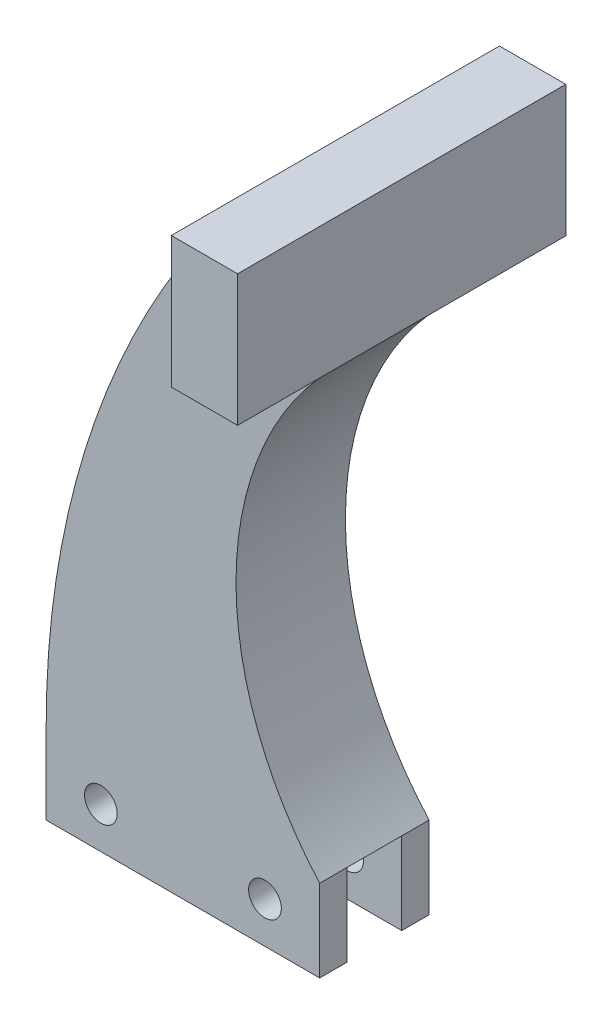
ISO-10303-21;
HEADER;
FILE_DESCRIPTION(('STEP AP214'),'2;1');
FILE_NAME('part.step','',(''),(''),'','','');
FILE_SCHEMA(('AUTOMOTIVE_DESIGN { 1 0 10303 214 1 1 1 1 }'));
ENDSEC;
DATA;
#1=APPLICATION_CONTEXT('core data for automotive mechanical design processes');
#2=APPLICATION_PROTOCOL_DEFINITION('international standard','automotive_design',2000,#1);
#3=PRODUCT_CONTEXT('',#1,'mechanical');
#4=PRODUCT('Part','Part','',(#3));
#5=PRODUCT_RELATED_PRODUCT_CATEGORY('part','',(#4));
#6=PRODUCT_DEFINITION_FORMATION('','',#4);
#7=PRODUCT_DEFINITION_CONTEXT('part definition',#1,'design');
#8=PRODUCT_DEFINITION('design','',#6,#7);
#9=PRODUCT_DEFINITION_SHAPE('','',#8);
#10=(LENGTH_UNIT() NAMED_UNIT(*) SI_UNIT(.MILLI.,.METRE.));
#11=(NAMED_UNIT(*) PLANE_ANGLE_UNIT() SI_UNIT($,.RADIAN.));
#12=(NAMED_UNIT(*) SI_UNIT($,.STERADIAN.) SOLID_ANGLE_UNIT());
#13=UNCERTAINTY_MEASURE_WITH_UNIT(LENGTH_MEASURE(1.E-05),#10,'distance_accuracy_value','');
#14=(GEOMETRIC_REPRESENTATION_CONTEXT(3) GLOBAL_UNCERTAINTY_ASSIGNED_CONTEXT((#13)) GLOBAL_UNIT_ASSIGNED_CONTEXT((#10,
#11,#12)) REPRESENTATION_CONTEXT('',''));
#15=CARTESIAN_POINT('',(0.,0.,0.));
#16=DIRECTION('',(0.,0.,1.));
#17=DIRECTION('',(1.,0.,0.));
#18=AXIS2_PLACEMENT_3D('',#15,#16,#17);
#19=CARTESIAN_POINT('',(85.725,9.525,-12.7));
#20=DIRECTION('',(0.,0.,1.));
#21=DIRECTION('',(1.,0.,0.));
#22=AXIS2_PLACEMENT_3D('',#19,#20,#21);
#23=PLANE('',#22);
#24=CARTESIAN_POINT('',(-9.525,4.7625,-12.7));
#25=DIRECTION('',(0.,0.,1.));
#26=DIRECTION('',(1.,0.,0.));
#27=AXIS2_PLACEMENT_3D('',#24,#25,#26);
#28=CIRCLE('',#27,1.89865);
#29=CARTESIAN_POINT('',(-7.62635,4.7625,-12.7));
#30=VERTEX_POINT('',#29);
#31=EDGE_CURVE('E211',#30,#30,#28,.T.);
#32=ORIENTED_EDGE('',*,*,#31,.T.);
#33=EDGE_LOOP('',(#32));
#34=FACE_BOUND('',#33,.T.);
#35=CARTESIAN_POINT('',(9.525,4.7625,-12.7));
#36=DIRECTION('',(0.,0.,1.));
#37=DIRECTION('',(1.,0.,0.));
#38=AXIS2_PLACEMENT_3D('',#35,#36,#37);
#39=CIRCLE('',#38,1.89865);
#40=CARTESIAN_POINT('',(11.42365,4.7625,-12.7));
#41=VERTEX_POINT('',#40);
#42=EDGE_CURVE('E199',#41,#41,#39,.T.);
#43=ORIENTED_EDGE('',*,*,#42,.T.);
#44=EDGE_LOOP('',(#43));
#45=FACE_BOUND('',#44,.T.);
#46=DIRECTION('',(0.,1.,0.));
#47=VECTOR('',#46,1.);
#48=CARTESIAN_POINT('',(11.3486342982531,9.52499999999999,-12.7));
#49=LINE('',#48,#47);
#50=CARTESIAN_POINT('',(11.3486342982531,63.5,-12.7));
#51=VERTEX_POINT('',#50);
#52=CARTESIAN_POINT('',(11.3486342982531,78.74,-12.7));
#53=VERTEX_POINT('',#52);
#54=EDGE_CURVE('E193',#51,#53,#49,.T.);
#55=ORIENTED_EDGE('',*,*,#54,.F.);
#56=DIRECTION('',(-1.,0.,0.));
#57=VECTOR('',#56,1.);
#58=CARTESIAN_POINT('',(85.725,63.5,-12.7));
#59=LINE('',#58,#57);
#60=CARTESIAN_POINT('',(19.05,63.5,-12.7));
#61=VERTEX_POINT('',#60);
#62=EDGE_CURVE('E190',#61,#51,#59,.T.);
#63=ORIENTED_EDGE('',*,*,#62,.F.);
#64=CARTESIAN_POINT('',(44.2632330501586,34.9359862911671,-12.7));
#65=DIRECTION('',(0.,0.,-1.));
#66=DIRECTION('',(1.,0.,0.));
#67=AXIS2_PLACEMENT_3D('',#64,#65,#66);
#68=CIRCLE('',#67,38.1);
#69=CARTESIAN_POINT('',(15.875,9.525,-12.7));
#70=VERTEX_POINT('',#69);
#71=EDGE_CURVE('E244',#70,#61,#68,.T.);
#72=ORIENTED_EDGE('',*,*,#71,.F.);
#73=DIRECTION('',(0.,1.,0.));
#74=VECTOR('',#73,1.);
#75=CARTESIAN_POINT('',(15.875,0.,-12.7));
#76=LINE('',#75,#74);
#77=CARTESIAN_POINT('',(15.875,0.,-12.7));
#78=VERTEX_POINT('',#77);
#79=EDGE_CURVE('E241',#78,#70,#76,.T.);
#80=ORIENTED_EDGE('',*,*,#79,.F.);
#81=DIRECTION('',(1.,0.,0.));
#82=VECTOR('',#81,1.);
#83=CARTESIAN_POINT('',(-15.875,0.,-12.7));
#84=LINE('',#83,#82);
#85=CARTESIAN_POINT('',(-15.875,0.,-12.7));
#86=VERTEX_POINT('',#85);
#87=EDGE_CURVE('E237',#86,#78,#84,.T.);
#88=ORIENTED_EDGE('',*,*,#87,.F.);
#89=DIRECTION('',(0.,-1.,0.));
#90=VECTOR('',#89,1.);
#91=CARTESIAN_POINT('',(-15.875,0.,-12.7));
#92=LINE('',#91,#90);
#93=CARTESIAN_POINT('',(-15.875,9.52500000000001,-12.7));
#94=VERTEX_POINT('',#93);
#95=EDGE_CURVE('E234',#94,#86,#92,.T.);
#96=ORIENTED_EDGE('',*,*,#95,.F.);
#97=CARTESIAN_POINT('',(85.725,9.525,-12.7));
#98=DIRECTION('',(0.,0.,1.));
#99=DIRECTION('',(1.,0.,0.));
#100=AXIS2_PLACEMENT_3D('',#97,#98,#99);
#101=CIRCLE('',#100,101.6);
#102=EDGE_CURVE('E247',#53,#94,#101,.T.);
#103=ORIENTED_EDGE('',*,*,#102,.F.);
#104=EDGE_LOOP('',(#55,#63,#72,#80,#88,#96,#103));
#105=FACE_BOUND('',#104,.T.);
#106=ADVANCED_FACE('F35',(#34,#45,#105),#23,.F.);
#107=CARTESIAN_POINT('',(85.725,9.525,0.));
#108=DIRECTION('',(0.,0.,1.));
#109=DIRECTION('',(1.,0.,0.));
#110=AXIS2_PLACEMENT_3D('',#107,#108,#109);
#111=PLANE('',#110);
#112=CARTESIAN_POINT('',(9.525,4.7625,0.));
#113=DIRECTION('',(0.,0.,1.));
#114=DIRECTION('',(1.,0.,0.));
#115=AXIS2_PLACEMENT_3D('',#112,#113,#114);
#116=CIRCLE('',#115,1.89865);
#117=CARTESIAN_POINT('',(11.42365,4.7625,0.));
#118=VERTEX_POINT('',#117);
#119=EDGE_CURVE('E196',#118,#118,#116,.T.);
#120=ORIENTED_EDGE('',*,*,#119,.F.);
#121=EDGE_LOOP('',(#120));
#122=FACE_BOUND('',#121,.T.);
#123=CARTESIAN_POINT('',(-9.525,4.7625,0.));
#124=DIRECTION('',(0.,0.,1.));
#125=DIRECTION('',(1.,0.,0.));
#126=AXIS2_PLACEMENT_3D('',#123,#124,#125);
#127=CIRCLE('',#126,1.89865);
#128=CARTESIAN_POINT('',(-7.62635,4.7625,0.));
#129=VERTEX_POINT('',#128);
#130=EDGE_CURVE('E208',#129,#129,#127,.T.);
#131=ORIENTED_EDGE('',*,*,#130,.F.);
#132=EDGE_LOOP('',(#131));
#133=FACE_BOUND('',#132,.T.);
#134=DIRECTION('',(-1.,0.,0.));
#135=VECTOR('',#134,1.);
#136=CARTESIAN_POINT('',(85.725,63.5,0.));
#137=LINE('',#136,#135);
#138=CARTESIAN_POINT('',(19.05,63.5,0.));
#139=VERTEX_POINT('',#138);
#140=CARTESIAN_POINT('',(11.3486342982531,63.5,0.));
#141=VERTEX_POINT('',#140);
#142=EDGE_CURVE('E43',#139,#141,#137,.T.);
#143=ORIENTED_EDGE('',*,*,#142,.T.);
#144=DIRECTION('',(0.,1.,0.));
#145=VECTOR('',#144,1.);
#146=CARTESIAN_POINT('',(11.3486342982531,9.52499999999999,0.));
#147=LINE('',#146,#145);
#148=CARTESIAN_POINT('',(11.3486342982531,78.74,0.));
#149=VERTEX_POINT('',#148);
#150=EDGE_CURVE('E11',#141,#149,#147,.T.);
#151=ORIENTED_EDGE('',*,*,#150,.T.);
#152=CARTESIAN_POINT('',(85.725,9.525,0.));
#153=DIRECTION('',(0.,0.,1.));
#154=DIRECTION('',(1.,0.,0.));
#155=AXIS2_PLACEMENT_3D('',#152,#153,#154);
#156=CIRCLE('',#155,101.6);
#157=CARTESIAN_POINT('',(-15.875,9.52500000000001,0.));
#158=VERTEX_POINT('',#157);
#159=EDGE_CURVE('E238',#149,#158,#156,.T.);
#160=ORIENTED_EDGE('',*,*,#159,.T.);
#161=DIRECTION('',(0.,-1.,0.));
#162=VECTOR('',#161,1.);
#163=CARTESIAN_POINT('',(-15.875,0.,0.));
#164=LINE('',#163,#162);
#165=CARTESIAN_POINT('',(-15.875,0.,0.));
#166=VERTEX_POINT('',#165);
#167=EDGE_CURVE('E233',#158,#166,#164,.T.);
#168=ORIENTED_EDGE('',*,*,#167,.T.);
#169=DIRECTION('',(1.,0.,0.));
#170=VECTOR('',#169,1.);
#171=CARTESIAN_POINT('',(-15.875,0.,0.));
#172=LINE('',#171,#170);
#173=CARTESIAN_POINT('',(15.875,0.,0.));
#174=VERTEX_POINT('',#173);
#175=EDGE_CURVE('E253',#166,#174,#172,.T.);
#176=ORIENTED_EDGE('',*,*,#175,.T.);
#177=DIRECTION('',(0.,1.,0.));
#178=VECTOR('',#177,1.);
#179=CARTESIAN_POINT('',(15.875,0.,0.));
#180=LINE('',#179,#178);
#181=CARTESIAN_POINT('',(15.875,9.525,0.));
#182=VERTEX_POINT('',#181);
#183=EDGE_CURVE('E256',#174,#182,#180,.T.);
#184=ORIENTED_EDGE('',*,*,#183,.T.);
#185=CARTESIAN_POINT('',(44.2632330501586,34.9359862911671,0.));
#186=DIRECTION('',(0.,0.,-1.));
#187=DIRECTION('',(1.,0.,0.));
#188=AXIS2_PLACEMENT_3D('',#185,#186,#187);
#189=CIRCLE('',#188,38.1);
#190=EDGE_CURVE('E259',#182,#139,#189,.T.);
#191=ORIENTED_EDGE('',*,*,#190,.T.);
#192=EDGE_LOOP('',(#143,#151,#160,#168,#176,#184,#191));
#193=FACE_BOUND('',#192,.T.);
#194=ADVANCED_FACE('F290',(#122,#133,#193),#111,.T.);
#195=CARTESIAN_POINT('',(-15.875,0.,-12.7));
#196=DIRECTION('',(-1.,0.,0.));
#197=DIRECTION('',(0.,0.,1.));
#198=AXIS2_PLACEMENT_3D('',#195,#196,#197);
#199=PLANE('',#198);
#200=DIRECTION('',(0.,-1.,0.));
#201=VECTOR('',#200,1.);
#202=CARTESIAN_POINT('',(-15.875,0.,-9.525));
#203=LINE('',#202,#201);
#204=CARTESIAN_POINT('',(-15.875,9.52499999999999,-9.525));
#205=VERTEX_POINT('',#204);
#206=CARTESIAN_POINT('',(-15.875,0.,-9.525));
#207=VERTEX_POINT('',#206);
#208=EDGE_CURVE('E224',#205,#207,#203,.T.);
#209=ORIENTED_EDGE('',*,*,#208,.F.);
#210=DIRECTION('',(0.,0.,1.));
#211=VECTOR('',#210,1.);
#212=CARTESIAN_POINT('',(-15.875,9.52500000000001,-12.7));
#213=LINE('',#212,#211);
#214=EDGE_CURVE('E264',#94,#205,#213,.T.);
#215=ORIENTED_EDGE('',*,*,#214,.F.);
#216=ORIENTED_EDGE('',*,*,#95,.T.);
#217=DIRECTION('',(0.,0.,1.));
#218=VECTOR('',#217,1.);
#219=CARTESIAN_POINT('',(-15.875,0.,-12.7));
#220=LINE('',#219,#218);
#221=EDGE_CURVE('E281',#86,#207,#220,.T.);
#222=ORIENTED_EDGE('',*,*,#221,.T.);
#223=EDGE_LOOP('',(#209,#215,#216,#222));
#224=FACE_BOUND('',#223,.T.);
#225=ADVANCED_FACE('F356',(#224),#199,.T.);
#226=CARTESIAN_POINT('',(15.875,0.,-12.7));
#227=DIRECTION('',(1.,0.,0.));
#228=DIRECTION('',(0.,0.,-1.));
#229=AXIS2_PLACEMENT_3D('',#226,#227,#228);
#230=PLANE('',#229);
#231=DIRECTION('',(0.,1.,0.));
#232=VECTOR('',#231,1.);
#233=CARTESIAN_POINT('',(15.875,0.,-9.525));
#234=LINE('',#233,#232);
#235=CARTESIAN_POINT('',(15.875,0.,-9.525));
#236=VERTEX_POINT('',#235);
#237=CARTESIAN_POINT('',(15.875,9.52499999999999,-9.525));
#238=VERTEX_POINT('',#237);
#239=EDGE_CURVE('E231',#236,#238,#234,.T.);
#240=ORIENTED_EDGE('',*,*,#239,.F.);
#241=DIRECTION('',(0.,0.,1.));
#242=VECTOR('',#241,1.);
#243=CARTESIAN_POINT('',(15.875,0.,-12.7));
#244=LINE('',#243,#242);
#245=EDGE_CURVE('E277',#78,#236,#244,.T.);
#246=ORIENTED_EDGE('',*,*,#245,.F.);
#247=ORIENTED_EDGE('',*,*,#79,.T.);
#248=DIRECTION('',(0.,0.,1.));
#249=VECTOR('',#248,1.);
#250=CARTESIAN_POINT('',(15.875,9.525,-12.7));
#251=LINE('',#250,#249);
#252=EDGE_CURVE('E272',#70,#238,#251,.T.);
#253=ORIENTED_EDGE('',*,*,#252,.T.);
#254=EDGE_LOOP('',(#240,#246,#247,#253));
#255=FACE_BOUND('',#254,.T.);
#256=ADVANCED_FACE('F370',(#255),#230,.T.);
#257=CARTESIAN_POINT('',(-15.875,0.,-12.7));
#258=DIRECTION('',(0.,-1.,0.));
#259=DIRECTION('',(1.,0.,0.));
#260=AXIS2_PLACEMENT_3D('',#257,#258,#259);
#261=PLANE('',#260);
#262=DIRECTION('',(1.,0.,0.));
#263=VECTOR('',#262,1.);
#264=CARTESIAN_POINT('',(-15.875,0.,-9.525));
#265=LINE('',#264,#263);
#266=EDGE_CURVE('E285',#207,#236,#265,.T.);
#267=ORIENTED_EDGE('',*,*,#266,.F.);
#268=ORIENTED_EDGE('',*,*,#221,.F.);
#269=ORIENTED_EDGE('',*,*,#87,.T.);
#270=ORIENTED_EDGE('',*,*,#245,.T.);
#271=EDGE_LOOP('',(#267,#268,#269,#270));
#272=FACE_BOUND('',#271,.T.);
#273=ADVANCED_FACE('F372',(#272),#261,.T.);
#274=DIRECTION('',(0.,1.,0.));
#275=VECTOR('',#274,1.);
#276=CARTESIAN_POINT('',(-15.875,9.52499999999999,-3.175));
#277=LINE('',#276,#275);
#278=CARTESIAN_POINT('',(-15.875,0.,-3.175));
#279=VERTEX_POINT('',#278);
#280=CARTESIAN_POINT('',(-15.875,9.52499999999999,-3.175));
#281=VERTEX_POINT('',#280);
#282=EDGE_CURVE('E218',#279,#281,#277,.T.);
#283=ORIENTED_EDGE('',*,*,#282,.F.);
#284=EDGE_CURVE('E250',#279,#166,#220,.T.);
#285=ORIENTED_EDGE('',*,*,#284,.T.);
#286=ORIENTED_EDGE('',*,*,#167,.F.);
#287=EDGE_CURVE('E268',#281,#158,#213,.T.);
#288=ORIENTED_EDGE('',*,*,#287,.F.);
#289=EDGE_LOOP('',(#283,#285,#286,#288));
#290=FACE_BOUND('',#289,.T.);
#291=ADVANCED_FACE('F37',(#290),#199,.T.);
#292=CARTESIAN_POINT('',(85.725,9.525,-12.7));
#293=DIRECTION('',(0.,0.,1.));
#294=DIRECTION('',(1.,0.,0.));
#295=AXIS2_PLACEMENT_3D('',#292,#293,#294);
#296=CYLINDRICAL_SURFACE('',#295,101.6);
#297=ORIENTED_EDGE('',*,*,#159,.F.);
#298=DIRECTION('',(0.,0.,1.));
#299=VECTOR('',#298,1.);
#300=CARTESIAN_POINT('',(11.3486342982531,78.74,-12.7));
#301=LINE('',#300,#299);
#302=EDGE_CURVE('E155',#53,#149,#301,.T.);
#303=ORIENTED_EDGE('',*,*,#302,.F.);
#304=ORIENTED_EDGE('',*,*,#102,.T.);
#305=ORIENTED_EDGE('',*,*,#214,.T.);
#306=DIRECTION('',(0.,0.,-1.));
#307=VECTOR('',#306,1.);
#308=CARTESIAN_POINT('',(-15.875,9.52499999999999,-9.525));
#309=LINE('',#308,#307);
#310=EDGE_CURVE('E221',#281,#205,#309,.T.);
#311=ORIENTED_EDGE('',*,*,#310,.F.);
#312=ORIENTED_EDGE('',*,*,#287,.T.);
#313=EDGE_LOOP('',(#297,#303,#304,#305,#311,#312));
#314=FACE_BOUND('',#313,.T.);
#315=ADVANCED_FACE('F317',(#314),#296,.T.);
#316=CARTESIAN_POINT('',(19.05,78.74,-12.7));
#317=DIRECTION('',(0.,1.,0.));
#318=DIRECTION('',(-1.,0.,0.));
#319=AXIS2_PLACEMENT_3D('',#316,#317,#318);
#320=PLANE('',#319);
#321=ORIENTED_EDGE('',*,*,#302,.T.);
#322=DIRECTION('',(0.,0.,-1.));
#323=VECTOR('',#322,1.);
#324=CARTESIAN_POINT('',(11.3486342982531,78.74,12.7));
#325=LINE('',#324,#323);
#326=CARTESIAN_POINT('',(11.3486342982531,78.74,12.7));
#327=VERTEX_POINT('',#326);
#328=EDGE_CURVE('E162',#327,#149,#325,.T.);
#329=ORIENTED_EDGE('',*,*,#328,.F.);
#330=DIRECTION('',(-1.,0.,0.));
#331=VECTOR('',#330,1.);
#332=CARTESIAN_POINT('',(19.05,78.74,12.7));
#333=LINE('',#332,#331);
#334=CARTESIAN_POINT('',(19.05,78.74,12.7));
#335=VERTEX_POINT('',#334);
#336=EDGE_CURVE('E159',#335,#327,#333,.T.);
#337=ORIENTED_EDGE('',*,*,#336,.F.);
#338=DIRECTION('',(0.,0.,1.));
#339=VECTOR('',#338,1.);
#340=CARTESIAN_POINT('',(19.05,78.74,-12.7));
#341=LINE('',#340,#339);
#342=CARTESIAN_POINT('',(19.05,78.74,-25.4));
#343=VERTEX_POINT('',#342);
#344=EDGE_CURVE('E144',#343,#335,#341,.T.);
#345=ORIENTED_EDGE('',*,*,#344,.F.);
#346=DIRECTION('',(-1.,0.,0.));
#347=VECTOR('',#346,1.);
#348=CARTESIAN_POINT('',(19.05,78.74,-25.4));
#349=LINE('',#348,#347);
#350=CARTESIAN_POINT('',(11.3486342982531,78.74,-25.4));
#351=VERTEX_POINT('',#350);
#352=EDGE_CURVE('E180',#343,#351,#349,.T.);
#353=ORIENTED_EDGE('',*,*,#352,.T.);
#354=EDGE_CURVE('E188',#53,#351,#325,.T.);
#355=ORIENTED_EDGE('',*,*,#354,.F.);
#356=EDGE_LOOP('',(#321,#329,#337,#345,#353,#355));
#357=FACE_BOUND('',#356,.T.);
#358=ADVANCED_FACE('F161',(#357),#320,.T.);
#359=CARTESIAN_POINT('',(19.05,63.5,-12.7));
#360=DIRECTION('',(1.,0.,0.));
#361=DIRECTION('',(0.,0.,-1.));
#362=AXIS2_PLACEMENT_3D('',#359,#360,#361);
#363=PLANE('',#362);
#364=ORIENTED_EDGE('',*,*,#344,.T.);
#365=DIRECTION('',(0.,1.,0.));
#366=VECTOR('',#365,1.);
#367=CARTESIAN_POINT('',(19.05,63.5,12.7));
#368=LINE('',#367,#366);
#369=CARTESIAN_POINT('',(19.05,63.5,12.7));
#370=VERTEX_POINT('',#369);
#371=EDGE_CURVE('E149',#370,#335,#368,.T.);
#372=ORIENTED_EDGE('',*,*,#371,.F.);
#373=DIRECTION('',(0.,0.,-1.));
#374=VECTOR('',#373,1.);
#375=CARTESIAN_POINT('',(19.05,63.5,12.7));
#376=LINE('',#375,#374);
#377=EDGE_CURVE('E184',#370,#139,#376,.T.);
#378=ORIENTED_EDGE('',*,*,#377,.T.);
#379=DIRECTION('',(0.,0.,1.));
#380=VECTOR('',#379,1.);
#381=CARTESIAN_POINT('',(19.05,63.5,-12.7));
#382=LINE('',#381,#380);
#383=EDGE_CURVE('E156',#61,#139,#382,.T.);
#384=ORIENTED_EDGE('',*,*,#383,.F.);
#385=CARTESIAN_POINT('',(19.05,63.5,-25.4));
#386=VERTEX_POINT('',#385);
#387=EDGE_CURVE('E178',#61,#386,#376,.T.);
#388=ORIENTED_EDGE('',*,*,#387,.T.);
#389=DIRECTION('',(0.,1.,0.));
#390=VECTOR('',#389,1.);
#391=CARTESIAN_POINT('',(19.05,63.5,-25.4));
#392=LINE('',#391,#390);
#393=EDGE_CURVE('E151',#386,#343,#392,.T.);
#394=ORIENTED_EDGE('',*,*,#393,.T.);
#395=EDGE_LOOP('',(#364,#372,#378,#384,#388,#394));
#396=FACE_BOUND('',#395,.T.);
#397=ADVANCED_FACE('F146',(#396),#363,.T.);
#398=CARTESIAN_POINT('',(44.2632330501586,34.9359862911671,-12.7));
#399=DIRECTION('',(0.,0.,1.));
#400=DIRECTION('',(1.,0.,0.));
#401=AXIS2_PLACEMENT_3D('',#398,#399,#400);
#402=CYLINDRICAL_SURFACE('',#401,38.1);
#403=ORIENTED_EDGE('',*,*,#190,.F.);
#404=CARTESIAN_POINT('',(15.875,9.52499999999999,-3.175));
#405=VERTEX_POINT('',#404);
#406=EDGE_CURVE('E276',#405,#182,#251,.T.);
#407=ORIENTED_EDGE('',*,*,#406,.F.);
#408=EDGE_CURVE('E275',#238,#405,#251,.T.);
#409=ORIENTED_EDGE('',*,*,#408,.F.);
#410=ORIENTED_EDGE('',*,*,#252,.F.);
#411=ORIENTED_EDGE('',*,*,#71,.T.);
#412=ORIENTED_EDGE('',*,*,#383,.T.);
#413=EDGE_LOOP('',(#403,#407,#409,#410,#411,#412));
#414=FACE_BOUND('',#413,.T.);
#415=ADVANCED_FACE('F295',(#414),#402,.F.);
#416=DIRECTION('',(0.,-1.,0.));
#417=VECTOR('',#416,1.);
#418=CARTESIAN_POINT('',(15.875,0.,-3.175));
#419=LINE('',#418,#417);
#420=CARTESIAN_POINT('',(15.875,0.,-3.175));
#421=VERTEX_POINT('',#420);
#422=EDGE_CURVE('E58',#405,#421,#419,.T.);
#423=ORIENTED_EDGE('',*,*,#422,.F.);
#424=ORIENTED_EDGE('',*,*,#406,.T.);
#425=ORIENTED_EDGE('',*,*,#183,.F.);
#426=EDGE_CURVE('E280',#421,#174,#244,.T.);
#427=ORIENTED_EDGE('',*,*,#426,.F.);
#428=EDGE_LOOP('',(#423,#424,#425,#427));
#429=FACE_BOUND('',#428,.T.);
#430=ADVANCED_FACE('F330',(#429),#230,.T.);
#431=DIRECTION('',(-1.,0.,0.));
#432=VECTOR('',#431,1.);
#433=CARTESIAN_POINT('',(-15.875,0.,-3.175));
#434=LINE('',#433,#432);
#435=EDGE_CURVE('E267',#421,#279,#434,.T.);
#436=ORIENTED_EDGE('',*,*,#435,.F.);
#437=ORIENTED_EDGE('',*,*,#426,.T.);
#438=ORIENTED_EDGE('',*,*,#175,.F.);
#439=ORIENTED_EDGE('',*,*,#284,.F.);
#440=EDGE_LOOP('',(#436,#437,#438,#439));
#441=FACE_BOUND('',#440,.T.);
#442=ADVANCED_FACE('F326',(#441),#261,.T.);
#443=CARTESIAN_POINT('',(19.05,0.,-9.525));
#444=DIRECTION('',(0.,0.,-1.));
#445=DIRECTION('',(0.,1.,0.));
#446=AXIS2_PLACEMENT_3D('',#443,#444,#445);
#447=PLANE('',#446);
#448=CARTESIAN_POINT('',(9.525,4.7625,-9.525));
#449=DIRECTION('',(0.,0.,-1.));
#450=DIRECTION('',(0.,1.,0.));
#451=AXIS2_PLACEMENT_3D('',#448,#449,#450);
#452=CIRCLE('',#451,1.89865);
#453=CARTESIAN_POINT('',(9.525,6.66115,-9.525));
#454=VERTEX_POINT('',#453);
#455=EDGE_CURVE('E202',#454,#454,#452,.T.);
#456=ORIENTED_EDGE('',*,*,#455,.T.);
#457=EDGE_LOOP('',(#456));
#458=FACE_BOUND('',#457,.T.);
#459=CARTESIAN_POINT('',(-9.525,4.7625,-9.525));
#460=DIRECTION('',(0.,0.,-1.));
#461=DIRECTION('',(0.,1.,0.));
#462=AXIS2_PLACEMENT_3D('',#459,#460,#461);
#463=CIRCLE('',#462,1.89865);
#464=CARTESIAN_POINT('',(-9.525,6.66115,-9.525));
#465=VERTEX_POINT('',#464);
#466=EDGE_CURVE('E215',#465,#465,#463,.T.);
#467=ORIENTED_EDGE('',*,*,#466,.T.);
#468=EDGE_LOOP('',(#467));
#469=FACE_BOUND('',#468,.T.);
#470=ORIENTED_EDGE('',*,*,#239,.T.);
#471=DIRECTION('',(-1.,0.,0.));
#472=VECTOR('',#471,1.);
#473=CARTESIAN_POINT('',(19.05,9.52499999999999,-9.525));
#474=LINE('',#473,#472);
#475=EDGE_CURVE('E227',#238,#205,#474,.T.);
#476=ORIENTED_EDGE('',*,*,#475,.T.);
#477=ORIENTED_EDGE('',*,*,#208,.T.);
#478=ORIENTED_EDGE('',*,*,#266,.T.);
#479=EDGE_LOOP('',(#470,#476,#477,#478));
#480=FACE_BOUND('',#479,.T.);
#481=ADVANCED_FACE('F346',(#458,#469,#480),#447,.F.);
#482=CARTESIAN_POINT('',(19.05,9.52499999999999,-9.525));
#483=DIRECTION('',(0.,1.,0.));
#484=DIRECTION('',(0.,0.,1.));
#485=AXIS2_PLACEMENT_3D('',#482,#483,#484);
#486=PLANE('',#485);
#487=ORIENTED_EDGE('',*,*,#408,.T.);
#488=DIRECTION('',(-1.,0.,0.));
#489=VECTOR('',#488,1.);
#490=CARTESIAN_POINT('',(19.05,9.52499999999999,-3.175));
#491=LINE('',#490,#489);
#492=EDGE_CURVE('E226',#405,#281,#491,.T.);
#493=ORIENTED_EDGE('',*,*,#492,.T.);
#494=ORIENTED_EDGE('',*,*,#310,.T.);
#495=ORIENTED_EDGE('',*,*,#475,.F.);
#496=EDGE_LOOP('',(#487,#493,#494,#495));
#497=FACE_BOUND('',#496,.T.);
#498=ADVANCED_FACE('F333',(#497),#486,.F.);
#499=CARTESIAN_POINT('',(19.05,9.52499999999999,-3.175));
#500=DIRECTION('',(0.,0.,1.));
#501=DIRECTION('',(0.,-1.,0.));
#502=AXIS2_PLACEMENT_3D('',#499,#500,#501);
#503=PLANE('',#502);
#504=CARTESIAN_POINT('',(9.525,4.7625,-3.175));
#505=DIRECTION('',(0.,0.,1.));
#506=DIRECTION('',(0.,-1.,0.));
#507=AXIS2_PLACEMENT_3D('',#504,#505,#506);
#508=CIRCLE('',#507,1.89865);
#509=CARTESIAN_POINT('',(9.525,2.86385,-3.175));
#510=VERTEX_POINT('',#509);
#511=EDGE_CURVE('E205',#510,#510,#508,.T.);
#512=ORIENTED_EDGE('',*,*,#511,.T.);
#513=EDGE_LOOP('',(#512));
#514=FACE_BOUND('',#513,.T.);
#515=CARTESIAN_POINT('',(-9.525,4.7625,-3.175));
#516=DIRECTION('',(0.,0.,1.));
#517=DIRECTION('',(0.,-1.,0.));
#518=AXIS2_PLACEMENT_3D('',#515,#516,#517);
#519=CIRCLE('',#518,1.89865);
#520=CARTESIAN_POINT('',(-9.525,2.86385,-3.175));
#521=VERTEX_POINT('',#520);
#522=EDGE_CURVE('E214',#521,#521,#519,.T.);
#523=ORIENTED_EDGE('',*,*,#522,.T.);
#524=EDGE_LOOP('',(#523));
#525=FACE_BOUND('',#524,.T.);
#526=ORIENTED_EDGE('',*,*,#422,.T.);
#527=ORIENTED_EDGE('',*,*,#435,.T.);
#528=ORIENTED_EDGE('',*,*,#282,.T.);
#529=ORIENTED_EDGE('',*,*,#492,.F.);
#530=EDGE_LOOP('',(#526,#527,#528,#529));
#531=FACE_BOUND('',#530,.T.);
#532=ADVANCED_FACE('F334',(#514,#525,#531),#503,.F.);
#533=CARTESIAN_POINT('',(-9.525,4.7625,0.));
#534=DIRECTION('',(0.,0.,1.));
#535=DIRECTION('',(1.,0.,0.));
#536=AXIS2_PLACEMENT_3D('',#533,#534,#535);
#537=CYLINDRICAL_SURFACE('',#536,1.89865);
#538=ORIENTED_EDGE('',*,*,#130,.T.);
#539=EDGE_LOOP('',(#538));
#540=FACE_BOUND('',#539,.T.);
#541=ORIENTED_EDGE('',*,*,#522,.F.);
#542=EDGE_LOOP('',(#541));
#543=FACE_BOUND('',#542,.T.);
#544=ADVANCED_FACE('F336',(#540,#543),#537,.F.);
#545=ORIENTED_EDGE('',*,*,#31,.F.);
#546=EDGE_LOOP('',(#545));
#547=FACE_BOUND('',#546,.T.);
#548=ORIENTED_EDGE('',*,*,#466,.F.);
#549=EDGE_LOOP('',(#548));
#550=FACE_BOUND('',#549,.T.);
#551=ADVANCED_FACE('F343',(#547,#550),#537,.F.);
#552=CARTESIAN_POINT('',(9.525,4.7625,0.));
#553=DIRECTION('',(0.,0.,1.));
#554=DIRECTION('',(1.,0.,0.));
#555=AXIS2_PLACEMENT_3D('',#552,#553,#554);
#556=CYLINDRICAL_SURFACE('',#555,1.89865);
#557=ORIENTED_EDGE('',*,*,#119,.T.);
#558=EDGE_LOOP('',(#557));
#559=FACE_BOUND('',#558,.T.);
#560=ORIENTED_EDGE('',*,*,#511,.F.);
#561=EDGE_LOOP('',(#560));
#562=FACE_BOUND('',#561,.T.);
#563=ADVANCED_FACE('F454',(#559,#562),#556,.F.);
#564=ORIENTED_EDGE('',*,*,#42,.F.);
#565=EDGE_LOOP('',(#564));
#566=FACE_BOUND('',#565,.T.);
#567=ORIENTED_EDGE('',*,*,#455,.F.);
#568=EDGE_LOOP('',(#567));
#569=FACE_BOUND('',#568,.T.);
#570=ADVANCED_FACE('F463',(#566,#569),#556,.F.);
#571=CARTESIAN_POINT('',(0.,0.,12.7));
#572=DIRECTION('',(0.,0.,1.));
#573=DIRECTION('',(1.,0.,0.));
#574=AXIS2_PLACEMENT_3D('',#571,#572,#573);
#575=PLANE('',#574);
#576=ORIENTED_EDGE('',*,*,#371,.T.);
#577=ORIENTED_EDGE('',*,*,#336,.T.);
#578=DIRECTION('',(0.,-1.,0.));
#579=VECTOR('',#578,1.);
#580=CARTESIAN_POINT('',(11.3486342982531,78.74,12.7));
#581=LINE('',#580,#579);
#582=CARTESIAN_POINT('',(11.3486342982531,63.5,12.7));
#583=VERTEX_POINT('',#582);
#584=EDGE_CURVE('E165',#327,#583,#581,.T.);
#585=ORIENTED_EDGE('',*,*,#584,.T.);
#586=DIRECTION('',(1.,0.,0.));
#587=VECTOR('',#586,1.);
#588=CARTESIAN_POINT('',(11.3486342982531,63.5,12.7));
#589=LINE('',#588,#587);
#590=EDGE_CURVE('E168',#583,#370,#589,.T.);
#591=ORIENTED_EDGE('',*,*,#590,.T.);
#592=EDGE_LOOP('',(#576,#577,#585,#591));
#593=FACE_BOUND('',#592,.T.);
#594=ADVANCED_FACE('F167',(#593),#575,.T.);
#595=CARTESIAN_POINT('',(11.3486342982531,63.5,12.7));
#596=DIRECTION('',(0.,1.,0.));
#597=DIRECTION('',(0.,0.,1.));
#598=AXIS2_PLACEMENT_3D('',#595,#596,#597);
#599=PLANE('',#598);
#600=ORIENTED_EDGE('',*,*,#142,.F.);
#601=ORIENTED_EDGE('',*,*,#377,.F.);
#602=ORIENTED_EDGE('',*,*,#590,.F.);
#603=DIRECTION('',(0.,0.,-1.));
#604=VECTOR('',#603,1.);
#605=CARTESIAN_POINT('',(11.3486342982531,63.5,12.7));
#606=LINE('',#605,#604);
#607=EDGE_CURVE('E50',#583,#141,#606,.T.);
#608=ORIENTED_EDGE('',*,*,#607,.T.);
#609=EDGE_LOOP('',(#600,#601,#602,#608));
#610=FACE_BOUND('',#609,.T.);
#611=ADVANCED_FACE('F292',(#610),#599,.F.);
#612=CARTESIAN_POINT('',(11.3486342982531,78.74,12.7));
#613=DIRECTION('',(1.,0.,0.));
#614=DIRECTION('',(0.,1.,0.));
#615=AXIS2_PLACEMENT_3D('',#612,#613,#614);
#616=PLANE('',#615);
#617=ORIENTED_EDGE('',*,*,#150,.F.);
#618=ORIENTED_EDGE('',*,*,#607,.F.);
#619=ORIENTED_EDGE('',*,*,#584,.F.);
#620=ORIENTED_EDGE('',*,*,#328,.T.);
#621=EDGE_LOOP('',(#617,#618,#619,#620));
#622=FACE_BOUND('',#621,.T.);
#623=ADVANCED_FACE('F506',(#622),#616,.F.);
#624=CARTESIAN_POINT('',(11.3486342982531,63.5,-25.4));
#625=VERTEX_POINT('',#624);
#626=EDGE_CURVE('E186',#51,#625,#606,.T.);
#627=ORIENTED_EDGE('',*,*,#626,.F.);
#628=ORIENTED_EDGE('',*,*,#54,.T.);
#629=ORIENTED_EDGE('',*,*,#354,.T.);
#630=DIRECTION('',(0.,-1.,0.));
#631=VECTOR('',#630,1.);
#632=CARTESIAN_POINT('',(11.3486342982531,78.74,-25.4));
#633=LINE('',#632,#631);
#634=EDGE_CURVE('E173',#351,#625,#633,.T.);
#635=ORIENTED_EDGE('',*,*,#634,.T.);
#636=EDGE_LOOP('',(#627,#628,#629,#635));
#637=FACE_BOUND('',#636,.T.);
#638=ADVANCED_FACE('F312',(#637),#616,.F.);
#639=ORIENTED_EDGE('',*,*,#387,.F.);
#640=ORIENTED_EDGE('',*,*,#62,.T.);
#641=ORIENTED_EDGE('',*,*,#626,.T.);
#642=DIRECTION('',(1.,0.,0.));
#643=VECTOR('',#642,1.);
#644=CARTESIAN_POINT('',(11.3486342982531,63.5,-25.4));
#645=LINE('',#644,#643);
#646=EDGE_CURVE('E170',#625,#386,#645,.T.);
#647=ORIENTED_EDGE('',*,*,#646,.T.);
#648=EDGE_LOOP('',(#639,#640,#641,#647));
#649=FACE_BOUND('',#648,.T.);
#650=ADVANCED_FACE('F303',(#649),#599,.F.);
#651=CARTESIAN_POINT('',(0.,0.,-25.4));
#652=DIRECTION('',(0.,0.,1.));
#653=DIRECTION('',(1.,0.,0.));
#654=AXIS2_PLACEMENT_3D('',#651,#652,#653);
#655=PLANE('',#654);
#656=ORIENTED_EDGE('',*,*,#393,.F.);
#657=ORIENTED_EDGE('',*,*,#646,.F.);
#658=ORIENTED_EDGE('',*,*,#634,.F.);
#659=ORIENTED_EDGE('',*,*,#352,.F.);
#660=EDGE_LOOP('',(#656,#657,#658,#659));
#661=FACE_BOUND('',#660,.T.);
#662=ADVANCED_FACE('F308',(#661),#655,.F.);
#663=CLOSED_SHELL('',(#106,#194,#225,#256,#273,#291,#315,#358,#397,#415,#430,#442,#481,#498,
#532,#544,#551,#563,#570,#594,#611,#623,#638,#650,#662));
#664=MANIFOLD_SOLID_BREP('B2',#663);
#665=ADVANCED_BREP_SHAPE_REPRESENTATION('',(#18,#664),#14);
#666=SHAPE_DEFINITION_REPRESENTATION(#9,#665);
ENDSEC;
END-ISO-10303-21;
